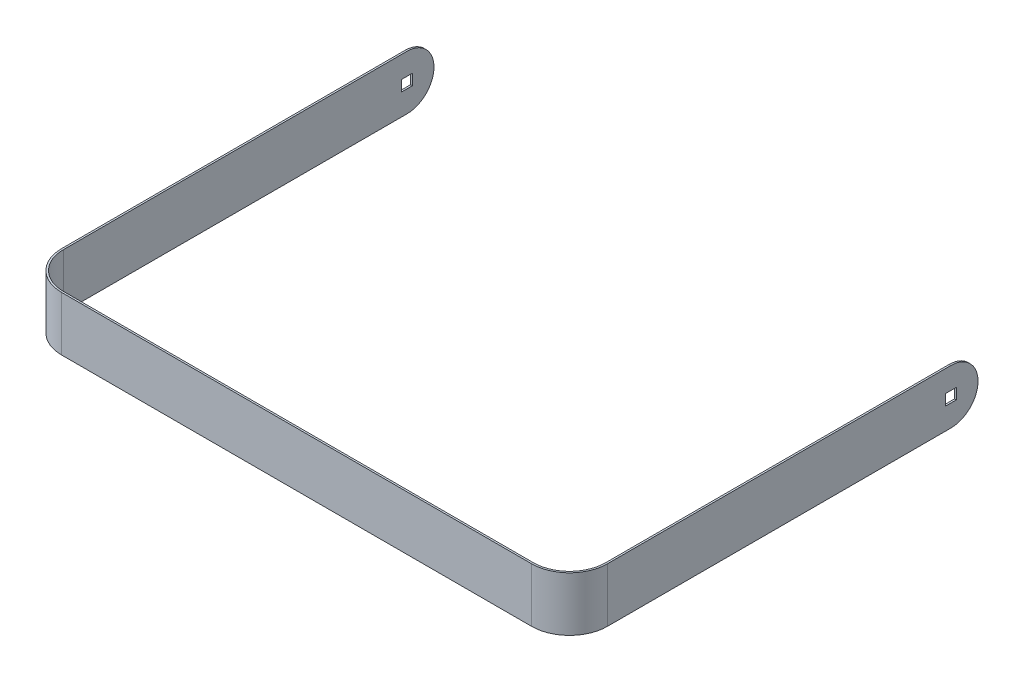
ISO-10303-21;
HEADER;
FILE_DESCRIPTION(('STEP AP214'),'2;1');
FILE_NAME('part.step','',(''),(''),'','','');
FILE_SCHEMA(('AUTOMOTIVE_DESIGN { 1 0 10303 214 1 1 1 1 }'));
ENDSEC;
DATA;
#1=APPLICATION_CONTEXT('core data for automotive mechanical design processes');
#2=APPLICATION_PROTOCOL_DEFINITION('international standard','automotive_design',2000,#1);
#3=PRODUCT_CONTEXT('',#1,'mechanical');
#4=PRODUCT('Part','Part','',(#3));
#5=PRODUCT_RELATED_PRODUCT_CATEGORY('part','',(#4));
#6=PRODUCT_DEFINITION_FORMATION('','',#4);
#7=PRODUCT_DEFINITION_CONTEXT('part definition',#1,'design');
#8=PRODUCT_DEFINITION('design','',#6,#7);
#9=PRODUCT_DEFINITION_SHAPE('','',#8);
#10=(LENGTH_UNIT() NAMED_UNIT(*) SI_UNIT(.MILLI.,.METRE.));
#11=(NAMED_UNIT(*) PLANE_ANGLE_UNIT() SI_UNIT($,.RADIAN.));
#12=(NAMED_UNIT(*) SI_UNIT($,.STERADIAN.) SOLID_ANGLE_UNIT());
#13=UNCERTAINTY_MEASURE_WITH_UNIT(LENGTH_MEASURE(1.E-05),#10,'distance_accuracy_value','');
#14=(GEOMETRIC_REPRESENTATION_CONTEXT(3) GLOBAL_UNCERTAINTY_ASSIGNED_CONTEXT((#13)) GLOBAL_UNIT_ASSIGNED_CONTEXT((#10,
#11,#12)) REPRESENTATION_CONTEXT('',''));
#15=CARTESIAN_POINT('',(0.,0.,0.));
#16=DIRECTION('',(0.,0.,1.));
#17=DIRECTION('',(1.,0.,0.));
#18=AXIS2_PLACEMENT_3D('',#15,#16,#17);
#19=CARTESIAN_POINT('',(130.,-30.,-21.));
#20=DIRECTION('',(0.,1.,0.));
#21=DIRECTION('',(0.,0.,1.));
#22=AXIS2_PLACEMENT_3D('',#19,#20,#21);
#23=PLANE('',#22);
#24=DIRECTION('',(1.,0.,0.));
#25=VECTOR('',#24,1.);
#26=CARTESIAN_POINT('',(-151.,-30.,-211.));
#27=LINE('',#26,#25);
#28=CARTESIAN_POINT('',(150.,-30.,-211.));
#29=VERTEX_POINT('',#28);
#30=CARTESIAN_POINT('',(151.,-30.,-211.));
#31=VERTEX_POINT('',#30);
#32=EDGE_CURVE('E235',#29,#31,#27,.T.);
#33=ORIENTED_EDGE('',*,*,#32,.T.);
#34=DIRECTION('',(0.,0.,-1.));
#35=VECTOR('',#34,1.);
#36=CARTESIAN_POINT('',(151.,-30.,-151.));
#37=LINE('',#36,#35);
#38=CARTESIAN_POINT('',(151.,-30.,-21.));
#39=VERTEX_POINT('',#38);
#40=EDGE_CURVE('E246',#39,#31,#37,.T.);
#41=ORIENTED_EDGE('',*,*,#40,.F.);
#42=CARTESIAN_POINT('',(130.,-30.,-21.));
#43=DIRECTION('',(0.,1.,0.));
#44=DIRECTION('',(0.,0.,1.));
#45=AXIS2_PLACEMENT_3D('',#42,#43,#44);
#46=CIRCLE('',#45,21.);
#47=CARTESIAN_POINT('',(130.,-30.,0.));
#48=VERTEX_POINT('',#47);
#49=EDGE_CURVE('E250',#48,#39,#46,.T.);
#50=ORIENTED_EDGE('',*,*,#49,.F.);
#51=DIRECTION('',(1.,0.,0.));
#52=VECTOR('',#51,1.);
#53=CARTESIAN_POINT('',(-130.,-30.,0.));
#54=LINE('',#53,#52);
#55=CARTESIAN_POINT('',(-130.,-30.,0.));
#56=VERTEX_POINT('',#55);
#57=EDGE_CURVE('E253',#56,#48,#54,.T.);
#58=ORIENTED_EDGE('',*,*,#57,.F.);
#59=CARTESIAN_POINT('',(-130.,-30.,-21.0000000000001));
#60=DIRECTION('',(0.,1.,0.));
#61=DIRECTION('',(0.,0.,1.));
#62=AXIS2_PLACEMENT_3D('',#59,#60,#61);
#63=CIRCLE('',#62,21.0000000000001);
#64=CARTESIAN_POINT('',(-151.,-30.,-21.0000000000001));
#65=VERTEX_POINT('',#64);
#66=EDGE_CURVE('E256',#65,#56,#63,.T.);
#67=ORIENTED_EDGE('',*,*,#66,.F.);
#68=DIRECTION('',(0.,0.,1.));
#69=VECTOR('',#68,1.);
#70=CARTESIAN_POINT('',(-151.,-30.,-151.));
#71=LINE('',#70,#69);
#72=CARTESIAN_POINT('',(-151.,-30.,-211.));
#73=VERTEX_POINT('',#72);
#74=EDGE_CURVE('E259',#73,#65,#71,.T.);
#75=ORIENTED_EDGE('',*,*,#74,.F.);
#76=CARTESIAN_POINT('',(-150.,-30.,-211.));
#77=VERTEX_POINT('',#76);
#78=EDGE_CURVE('E231',#73,#77,#27,.T.);
#79=ORIENTED_EDGE('',*,*,#78,.T.);
#80=DIRECTION('',(0.,0.,1.));
#81=VECTOR('',#80,1.);
#82=CARTESIAN_POINT('',(-150.,-30.,-151.));
#83=LINE('',#82,#81);
#84=CARTESIAN_POINT('',(-150.,-30.,-21.0000000000001));
#85=VERTEX_POINT('',#84);
#86=EDGE_CURVE('E261',#77,#85,#83,.T.);
#87=ORIENTED_EDGE('',*,*,#86,.T.);
#88=CARTESIAN_POINT('',(-130.,-30.,-21.0000000000001));
#89=DIRECTION('',(0.,-1.,0.));
#90=DIRECTION('',(1.,0.,0.));
#91=AXIS2_PLACEMENT_3D('',#88,#89,#90);
#92=CIRCLE('',#91,20.0000000000001);
#93=CARTESIAN_POINT('',(-130.,-30.,-1.));
#94=VERTEX_POINT('',#93);
#95=EDGE_CURVE('E263',#85,#94,#92,.F.);
#96=ORIENTED_EDGE('',*,*,#95,.T.);
#97=DIRECTION('',(1.,0.,0.));
#98=VECTOR('',#97,1.);
#99=CARTESIAN_POINT('',(-130.,-30.,-1.));
#100=LINE('',#99,#98);
#101=CARTESIAN_POINT('',(130.,-30.,-0.999999999999997));
#102=VERTEX_POINT('',#101);
#103=EDGE_CURVE('E265',#94,#102,#100,.T.);
#104=ORIENTED_EDGE('',*,*,#103,.T.);
#105=CARTESIAN_POINT('',(130.,-30.,-21.));
#106=DIRECTION('',(0.,-1.,0.));
#107=DIRECTION('',(1.,0.,0.));
#108=AXIS2_PLACEMENT_3D('',#105,#106,#107);
#109=CIRCLE('',#108,20.);
#110=CARTESIAN_POINT('',(150.,-30.,-21.));
#111=VERTEX_POINT('',#110);
#112=EDGE_CURVE('E267',#102,#111,#109,.F.);
#113=ORIENTED_EDGE('',*,*,#112,.T.);
#114=DIRECTION('',(0.,0.,-1.));
#115=VECTOR('',#114,1.);
#116=CARTESIAN_POINT('',(150.,-30.,-151.));
#117=LINE('',#116,#115);
#118=EDGE_CURVE('E243',#111,#29,#117,.T.);
#119=ORIENTED_EDGE('',*,*,#118,.T.);
#120=EDGE_LOOP('',(#33,#41,#50,#58,#67,#75,#79,#87,#96,#104,#113,#119));
#121=FACE_BOUND('',#120,.T.);
#122=ADVANCED_FACE('F31',(#121),#23,.F.);
#123=CARTESIAN_POINT('',(130.,0.,-21.));
#124=DIRECTION('',(0.,1.,0.));
#125=DIRECTION('',(0.,0.,1.));
#126=AXIS2_PLACEMENT_3D('',#123,#124,#125);
#127=PLANE('',#126);
#128=DIRECTION('',(0.,0.,-1.));
#129=VECTOR('',#128,1.);
#130=CARTESIAN_POINT('',(151.,0.,-21.));
#131=LINE('',#130,#129);
#132=CARTESIAN_POINT('',(151.,0.,-21.));
#133=VERTEX_POINT('',#132);
#134=CARTESIAN_POINT('',(151.,0.,-211.));
#135=VERTEX_POINT('',#134);
#136=EDGE_CURVE('E242',#133,#135,#131,.T.);
#137=ORIENTED_EDGE('',*,*,#136,.T.);
#138=DIRECTION('',(1.,0.,0.));
#139=VECTOR('',#138,1.);
#140=CARTESIAN_POINT('',(-151.,0.,-211.));
#141=LINE('',#140,#139);
#142=CARTESIAN_POINT('',(150.,0.,-211.));
#143=VERTEX_POINT('',#142);
#144=EDGE_CURVE('E314',#135,#143,#141,.F.);
#145=ORIENTED_EDGE('',*,*,#144,.T.);
#146=DIRECTION('',(0.,0.,1.));
#147=VECTOR('',#146,1.);
#148=CARTESIAN_POINT('',(150.,0.,-21.));
#149=LINE('',#148,#147);
#150=CARTESIAN_POINT('',(150.,0.,-21.));
#151=VERTEX_POINT('',#150);
#152=EDGE_CURVE('E247',#151,#143,#149,.F.);
#153=ORIENTED_EDGE('',*,*,#152,.F.);
#154=CARTESIAN_POINT('',(130.,0.,-21.));
#155=DIRECTION('',(0.,-1.,0.));
#156=DIRECTION('',(1.,0.,0.));
#157=AXIS2_PLACEMENT_3D('',#154,#155,#156);
#158=CIRCLE('',#157,20.);
#159=CARTESIAN_POINT('',(130.,0.,-0.999999999999997));
#160=VERTEX_POINT('',#159);
#161=EDGE_CURVE('E290',#160,#151,#158,.F.);
#162=ORIENTED_EDGE('',*,*,#161,.F.);
#163=DIRECTION('',(1.,0.,0.));
#164=VECTOR('',#163,1.);
#165=CARTESIAN_POINT('',(-130.,0.,-1.));
#166=LINE('',#165,#164);
#167=CARTESIAN_POINT('',(-130.,0.,-1.));
#168=VERTEX_POINT('',#167);
#169=EDGE_CURVE('E288',#168,#160,#166,.T.);
#170=ORIENTED_EDGE('',*,*,#169,.F.);
#171=CARTESIAN_POINT('',(-130.,0.,-21.0000000000001));
#172=DIRECTION('',(0.,-1.,0.));
#173=DIRECTION('',(1.,0.,0.));
#174=AXIS2_PLACEMENT_3D('',#171,#172,#173);
#175=CIRCLE('',#174,20.0000000000001);
#176=CARTESIAN_POINT('',(-150.,0.,-21.0000000000001));
#177=VERTEX_POINT('',#176);
#178=EDGE_CURVE('E286',#177,#168,#175,.F.);
#179=ORIENTED_EDGE('',*,*,#178,.F.);
#180=DIRECTION('',(0.,0.,1.));
#181=VECTOR('',#180,1.);
#182=CARTESIAN_POINT('',(-150.,0.,-151.));
#183=LINE('',#182,#181);
#184=CARTESIAN_POINT('',(-150.,0.,-211.));
#185=VERTEX_POINT('',#184);
#186=EDGE_CURVE('E284',#185,#177,#183,.T.);
#187=ORIENTED_EDGE('',*,*,#186,.F.);
#188=DIRECTION('',(1.,0.,0.));
#189=VECTOR('',#188,1.);
#190=CARTESIAN_POINT('',(-151.,0.,-211.));
#191=LINE('',#190,#189);
#192=CARTESIAN_POINT('',(-151.,0.,-211.));
#193=VERTEX_POINT('',#192);
#194=EDGE_CURVE('E229',#193,#185,#191,.T.);
#195=ORIENTED_EDGE('',*,*,#194,.F.);
#196=DIRECTION('',(0.,0.,1.));
#197=VECTOR('',#196,1.);
#198=CARTESIAN_POINT('',(-151.,0.,-151.));
#199=LINE('',#198,#197);
#200=CARTESIAN_POINT('',(-151.,0.,-21.0000000000001));
#201=VERTEX_POINT('',#200);
#202=EDGE_CURVE('E282',#193,#201,#199,.T.);
#203=ORIENTED_EDGE('',*,*,#202,.T.);
#204=CARTESIAN_POINT('',(-130.,0.,-21.0000000000001));
#205=DIRECTION('',(0.,1.,0.));
#206=DIRECTION('',(0.,0.,1.));
#207=AXIS2_PLACEMENT_3D('',#204,#205,#206);
#208=CIRCLE('',#207,21.0000000000001);
#209=CARTESIAN_POINT('',(-130.,0.,0.));
#210=VERTEX_POINT('',#209);
#211=EDGE_CURVE('E279',#201,#210,#208,.T.);
#212=ORIENTED_EDGE('',*,*,#211,.T.);
#213=DIRECTION('',(1.,0.,0.));
#214=VECTOR('',#213,1.);
#215=CARTESIAN_POINT('',(-130.,0.,0.));
#216=LINE('',#215,#214);
#217=CARTESIAN_POINT('',(130.,0.,0.));
#218=VERTEX_POINT('',#217);
#219=EDGE_CURVE('E276',#210,#218,#216,.T.);
#220=ORIENTED_EDGE('',*,*,#219,.T.);
#221=CARTESIAN_POINT('',(130.,0.,-21.));
#222=DIRECTION('',(0.,1.,0.));
#223=DIRECTION('',(0.,0.,1.));
#224=AXIS2_PLACEMENT_3D('',#221,#222,#223);
#225=CIRCLE('',#224,21.);
#226=EDGE_CURVE('E273',#218,#133,#225,.T.);
#227=ORIENTED_EDGE('',*,*,#226,.T.);
#228=EDGE_LOOP('',(#137,#145,#153,#162,#170,#179,#187,#195,#203,#212,#220,#227));
#229=FACE_BOUND('',#228,.T.);
#230=ADVANCED_FACE('F352',(#229),#127,.T.);
#231=CARTESIAN_POINT('',(151.,-30.,-21.));
#232=DIRECTION('',(1.,0.,0.));
#233=DIRECTION('',(0.,0.,-1.));
#234=AXIS2_PLACEMENT_3D('',#231,#232,#233);
#235=PLANE('',#234);
#236=DIRECTION('',(0.,-1.,0.));
#237=VECTOR('',#236,1.);
#238=CARTESIAN_POINT('',(151.,-12.,-208.));
#239=LINE('',#238,#237);
#240=CARTESIAN_POINT('',(151.,-12.,-208.));
#241=VERTEX_POINT('',#240);
#242=CARTESIAN_POINT('',(151.,-18.,-208.));
#243=VERTEX_POINT('',#242);
#244=EDGE_CURVE('E46',#241,#243,#239,.T.);
#245=ORIENTED_EDGE('',*,*,#244,.F.);
#246=DIRECTION('',(0.,0.,1.));
#247=VECTOR('',#246,1.);
#248=CARTESIAN_POINT('',(151.,-12.,-208.));
#249=LINE('',#248,#247);
#250=CARTESIAN_POINT('',(151.,-12.,-214.));
#251=VERTEX_POINT('',#250);
#252=EDGE_CURVE('E194',#251,#241,#249,.T.);
#253=ORIENTED_EDGE('',*,*,#252,.F.);
#254=DIRECTION('',(0.,1.,0.));
#255=VECTOR('',#254,1.);
#256=CARTESIAN_POINT('',(151.,-12.,-214.));
#257=LINE('',#256,#255);
#258=CARTESIAN_POINT('',(151.,-18.,-214.));
#259=VERTEX_POINT('',#258);
#260=EDGE_CURVE('E197',#259,#251,#257,.T.);
#261=ORIENTED_EDGE('',*,*,#260,.F.);
#262=DIRECTION('',(0.,0.,-1.));
#263=VECTOR('',#262,1.);
#264=CARTESIAN_POINT('',(151.,-18.,-208.));
#265=LINE('',#264,#263);
#266=EDGE_CURVE('E203',#243,#259,#265,.T.);
#267=ORIENTED_EDGE('',*,*,#266,.F.);
#268=EDGE_LOOP('',(#245,#253,#261,#267));
#269=FACE_BOUND('',#268,.T.);
#270=CARTESIAN_POINT('',(151.,-15.,-211.));
#271=DIRECTION('',(-1.,0.,0.));
#272=DIRECTION('',(0.,0.,1.));
#273=AXIS2_PLACEMENT_3D('',#270,#271,#272);
#274=CIRCLE('',#273,15.);
#275=EDGE_CURVE('E225',#135,#31,#274,.T.);
#276=ORIENTED_EDGE('',*,*,#275,.F.);
#277=ORIENTED_EDGE('',*,*,#136,.F.);
#278=DIRECTION('',(0.,1.,0.));
#279=VECTOR('',#278,1.);
#280=CARTESIAN_POINT('',(151.,-30.,-21.));
#281=LINE('',#280,#279);
#282=EDGE_CURVE('E312',#39,#133,#281,.T.);
#283=ORIENTED_EDGE('',*,*,#282,.F.);
#284=ORIENTED_EDGE('',*,*,#40,.T.);
#285=EDGE_LOOP('',(#276,#277,#283,#284));
#286=FACE_BOUND('',#285,.T.);
#287=ADVANCED_FACE('F33',(#269,#286),#235,.T.);
#288=CARTESIAN_POINT('',(130.,-30.,-21.));
#289=DIRECTION('',(0.,1.,0.));
#290=DIRECTION('',(0.,0.,1.));
#291=AXIS2_PLACEMENT_3D('',#288,#289,#290);
#292=CYLINDRICAL_SURFACE('',#291,21.);
#293=ORIENTED_EDGE('',*,*,#226,.F.);
#294=DIRECTION('',(0.,1.,0.));
#295=VECTOR('',#294,1.);
#296=CARTESIAN_POINT('',(130.,-30.,0.));
#297=LINE('',#296,#295);
#298=EDGE_CURVE('E310',#48,#218,#297,.T.);
#299=ORIENTED_EDGE('',*,*,#298,.F.);
#300=ORIENTED_EDGE('',*,*,#49,.T.);
#301=ORIENTED_EDGE('',*,*,#282,.T.);
#302=EDGE_LOOP('',(#293,#299,#300,#301));
#303=FACE_BOUND('',#302,.T.);
#304=ADVANCED_FACE('F390',(#303),#292,.T.);
#305=CARTESIAN_POINT('',(-130.,-30.,0.));
#306=DIRECTION('',(0.,0.,1.));
#307=DIRECTION('',(1.,0.,0.));
#308=AXIS2_PLACEMENT_3D('',#305,#306,#307);
#309=PLANE('',#308);
#310=ORIENTED_EDGE('',*,*,#219,.F.);
#311=DIRECTION('',(0.,1.,0.));
#312=VECTOR('',#311,1.);
#313=CARTESIAN_POINT('',(-130.,-30.,0.));
#314=LINE('',#313,#312);
#315=EDGE_CURVE('E308',#56,#210,#314,.T.);
#316=ORIENTED_EDGE('',*,*,#315,.F.);
#317=ORIENTED_EDGE('',*,*,#57,.T.);
#318=ORIENTED_EDGE('',*,*,#298,.T.);
#319=EDGE_LOOP('',(#310,#316,#317,#318));
#320=FACE_BOUND('',#319,.T.);
#321=ADVANCED_FACE('F387',(#320),#309,.T.);
#322=CARTESIAN_POINT('',(-130.,-30.,-21.0000000000001));
#323=DIRECTION('',(0.,1.,0.));
#324=DIRECTION('',(0.,0.,1.));
#325=AXIS2_PLACEMENT_3D('',#322,#323,#324);
#326=CYLINDRICAL_SURFACE('',#325,21.0000000000001);
#327=ORIENTED_EDGE('',*,*,#211,.F.);
#328=DIRECTION('',(0.,1.,0.));
#329=VECTOR('',#328,1.);
#330=CARTESIAN_POINT('',(-151.,-30.,-21.0000000000001));
#331=LINE('',#330,#329);
#332=EDGE_CURVE('E305',#65,#201,#331,.T.);
#333=ORIENTED_EDGE('',*,*,#332,.F.);
#334=ORIENTED_EDGE('',*,*,#66,.T.);
#335=ORIENTED_EDGE('',*,*,#315,.T.);
#336=EDGE_LOOP('',(#327,#333,#334,#335));
#337=FACE_BOUND('',#336,.T.);
#338=ADVANCED_FACE('F384',(#337),#326,.T.);
#339=CARTESIAN_POINT('',(-151.,-30.,-151.));
#340=DIRECTION('',(-1.,0.,0.));
#341=DIRECTION('',(0.,0.,1.));
#342=AXIS2_PLACEMENT_3D('',#339,#340,#341);
#343=PLANE('',#342);
#344=DIRECTION('',(0.,-1.,0.));
#345=VECTOR('',#344,1.);
#346=CARTESIAN_POINT('',(-151.,-12.,-208.));
#347=LINE('',#346,#345);
#348=CARTESIAN_POINT('',(-151.,-12.,-208.));
#349=VERTEX_POINT('',#348);
#350=CARTESIAN_POINT('',(-151.,-18.,-208.));
#351=VERTEX_POINT('',#350);
#352=EDGE_CURVE('E175',#349,#351,#347,.T.);
#353=ORIENTED_EDGE('',*,*,#352,.T.);
#354=DIRECTION('',(0.,0.,-1.));
#355=VECTOR('',#354,1.);
#356=CARTESIAN_POINT('',(-151.,-18.,-208.));
#357=LINE('',#356,#355);
#358=CARTESIAN_POINT('',(-151.,-18.,-214.));
#359=VERTEX_POINT('',#358);
#360=EDGE_CURVE('E185',#351,#359,#357,.T.);
#361=ORIENTED_EDGE('',*,*,#360,.T.);
#362=DIRECTION('',(0.,1.,0.));
#363=VECTOR('',#362,1.);
#364=CARTESIAN_POINT('',(-151.,-12.,-214.));
#365=LINE('',#364,#363);
#366=CARTESIAN_POINT('',(-151.,-12.,-214.));
#367=VERTEX_POINT('',#366);
#368=EDGE_CURVE('E54',#359,#367,#365,.T.);
#369=ORIENTED_EDGE('',*,*,#368,.T.);
#370=DIRECTION('',(0.,0.,1.));
#371=VECTOR('',#370,1.);
#372=CARTESIAN_POINT('',(-151.,-12.,-208.));
#373=LINE('',#372,#371);
#374=EDGE_CURVE('E193',#367,#349,#373,.T.);
#375=ORIENTED_EDGE('',*,*,#374,.T.);
#376=EDGE_LOOP('',(#353,#361,#369,#375));
#377=FACE_BOUND('',#376,.T.);
#378=CARTESIAN_POINT('',(-151.,-15.,-211.));
#379=DIRECTION('',(-1.,0.,0.));
#380=DIRECTION('',(0.,0.,1.));
#381=AXIS2_PLACEMENT_3D('',#378,#379,#380);
#382=CIRCLE('',#381,15.);
#383=EDGE_CURVE('E226',#193,#73,#382,.T.);
#384=ORIENTED_EDGE('',*,*,#383,.T.);
#385=ORIENTED_EDGE('',*,*,#74,.T.);
#386=ORIENTED_EDGE('',*,*,#332,.T.);
#387=ORIENTED_EDGE('',*,*,#202,.F.);
#388=EDGE_LOOP('',(#384,#385,#386,#387));
#389=FACE_BOUND('',#388,.T.);
#390=ADVANCED_FACE('F190',(#377,#389),#343,.T.);
#391=CARTESIAN_POINT('',(-150.,-30.,-151.));
#392=DIRECTION('',(-1.,0.,0.));
#393=DIRECTION('',(0.,0.,1.));
#394=AXIS2_PLACEMENT_3D('',#391,#392,#393);
#395=PLANE('',#394);
#396=DIRECTION('',(0.,0.,1.));
#397=VECTOR('',#396,1.);
#398=CARTESIAN_POINT('',(-150.,-18.,-151.));
#399=LINE('',#398,#397);
#400=CARTESIAN_POINT('',(-150.,-18.,-214.));
#401=VERTEX_POINT('',#400);
#402=CARTESIAN_POINT('',(-150.,-18.,-208.));
#403=VERTEX_POINT('',#402);
#404=EDGE_CURVE('E210',#401,#403,#399,.T.);
#405=ORIENTED_EDGE('',*,*,#404,.T.);
#406=DIRECTION('',(0.,1.,0.));
#407=VECTOR('',#406,1.);
#408=CARTESIAN_POINT('',(-150.,-30.,-208.));
#409=LINE('',#408,#407);
#410=CARTESIAN_POINT('',(-150.,-12.,-208.));
#411=VERTEX_POINT('',#410);
#412=EDGE_CURVE('E178',#403,#411,#409,.T.);
#413=ORIENTED_EDGE('',*,*,#412,.T.);
#414=DIRECTION('',(0.,0.,-1.));
#415=VECTOR('',#414,1.);
#416=CARTESIAN_POINT('',(-150.,-12.,-151.));
#417=LINE('',#416,#415);
#418=CARTESIAN_POINT('',(-150.,-12.,-214.));
#419=VERTEX_POINT('',#418);
#420=EDGE_CURVE('E221',#411,#419,#417,.T.);
#421=ORIENTED_EDGE('',*,*,#420,.T.);
#422=DIRECTION('',(0.,-1.,0.));
#423=VECTOR('',#422,1.);
#424=CARTESIAN_POINT('',(-150.,-30.,-214.));
#425=LINE('',#424,#423);
#426=EDGE_CURVE('E218',#419,#401,#425,.T.);
#427=ORIENTED_EDGE('',*,*,#426,.T.);
#428=EDGE_LOOP('',(#405,#413,#421,#427));
#429=FACE_BOUND('',#428,.T.);
#430=ORIENTED_EDGE('',*,*,#86,.F.);
#431=CARTESIAN_POINT('',(-150.,-15.,-211.));
#432=DIRECTION('',(-1.,0.,0.));
#433=DIRECTION('',(0.,0.,1.));
#434=AXIS2_PLACEMENT_3D('',#431,#432,#433);
#435=CIRCLE('',#434,15.);
#436=EDGE_CURVE('E240',#77,#185,#435,.F.);
#437=ORIENTED_EDGE('',*,*,#436,.T.);
#438=ORIENTED_EDGE('',*,*,#186,.T.);
#439=DIRECTION('',(0.,1.,0.));
#440=VECTOR('',#439,1.);
#441=CARTESIAN_POINT('',(-150.,-30.,-21.0000000000001));
#442=LINE('',#441,#440);
#443=EDGE_CURVE('E302',#85,#177,#442,.T.);
#444=ORIENTED_EDGE('',*,*,#443,.F.);
#445=EDGE_LOOP('',(#430,#437,#438,#444));
#446=FACE_BOUND('',#445,.T.);
#447=ADVANCED_FACE('F377',(#429,#446),#395,.F.);
#448=CARTESIAN_POINT('',(-130.,-30.,-21.0000000000001));
#449=DIRECTION('',(0.,1.,0.));
#450=DIRECTION('',(0.,0.,1.));
#451=AXIS2_PLACEMENT_3D('',#448,#449,#450);
#452=CYLINDRICAL_SURFACE('',#451,20.0000000000001);
#453=ORIENTED_EDGE('',*,*,#178,.T.);
#454=DIRECTION('',(0.,1.,0.));
#455=VECTOR('',#454,1.);
#456=CARTESIAN_POINT('',(-130.,-30.,-1.));
#457=LINE('',#456,#455);
#458=EDGE_CURVE('E299',#94,#168,#457,.T.);
#459=ORIENTED_EDGE('',*,*,#458,.F.);
#460=ORIENTED_EDGE('',*,*,#95,.F.);
#461=ORIENTED_EDGE('',*,*,#443,.T.);
#462=EDGE_LOOP('',(#453,#459,#460,#461));
#463=FACE_BOUND('',#462,.T.);
#464=ADVANCED_FACE('F373',(#463),#452,.F.);
#465=CARTESIAN_POINT('',(-130.,-30.,-1.));
#466=DIRECTION('',(0.,0.,1.));
#467=DIRECTION('',(1.,0.,0.));
#468=AXIS2_PLACEMENT_3D('',#465,#466,#467);
#469=PLANE('',#468);
#470=ORIENTED_EDGE('',*,*,#169,.T.);
#471=DIRECTION('',(0.,1.,0.));
#472=VECTOR('',#471,1.);
#473=CARTESIAN_POINT('',(130.,-30.,-0.999999999999997));
#474=LINE('',#473,#472);
#475=EDGE_CURVE('E296',#102,#160,#474,.T.);
#476=ORIENTED_EDGE('',*,*,#475,.F.);
#477=ORIENTED_EDGE('',*,*,#103,.F.);
#478=ORIENTED_EDGE('',*,*,#458,.T.);
#479=EDGE_LOOP('',(#470,#476,#477,#478));
#480=FACE_BOUND('',#479,.T.);
#481=ADVANCED_FACE('F369',(#480),#469,.F.);
#482=CARTESIAN_POINT('',(130.,-30.,-21.));
#483=DIRECTION('',(0.,1.,0.));
#484=DIRECTION('',(0.,0.,1.));
#485=AXIS2_PLACEMENT_3D('',#482,#483,#484);
#486=CYLINDRICAL_SURFACE('',#485,20.);
#487=ORIENTED_EDGE('',*,*,#161,.T.);
#488=DIRECTION('',(0.,1.,0.));
#489=VECTOR('',#488,1.);
#490=CARTESIAN_POINT('',(150.,-30.,-21.));
#491=LINE('',#490,#489);
#492=EDGE_CURVE('E270',#111,#151,#491,.T.);
#493=ORIENTED_EDGE('',*,*,#492,.F.);
#494=ORIENTED_EDGE('',*,*,#112,.F.);
#495=ORIENTED_EDGE('',*,*,#475,.T.);
#496=EDGE_LOOP('',(#487,#493,#494,#495));
#497=FACE_BOUND('',#496,.T.);
#498=ADVANCED_FACE('F366',(#497),#486,.F.);
#499=CARTESIAN_POINT('',(150.,-30.,-21.));
#500=DIRECTION('',(1.,0.,0.));
#501=DIRECTION('',(0.,0.,-1.));
#502=AXIS2_PLACEMENT_3D('',#499,#500,#501);
#503=PLANE('',#502);
#504=DIRECTION('',(0.,0.,1.));
#505=VECTOR('',#504,1.);
#506=CARTESIAN_POINT('',(150.,-12.,-21.));
#507=LINE('',#506,#505);
#508=CARTESIAN_POINT('',(150.,-12.,-214.));
#509=VERTEX_POINT('',#508);
#510=CARTESIAN_POINT('',(150.,-12.,-208.));
#511=VERTEX_POINT('',#510);
#512=EDGE_CURVE('E39',#509,#511,#507,.T.);
#513=ORIENTED_EDGE('',*,*,#512,.T.);
#514=DIRECTION('',(0.,-1.,0.));
#515=VECTOR('',#514,1.);
#516=CARTESIAN_POINT('',(150.,-30.,-208.));
#517=LINE('',#516,#515);
#518=CARTESIAN_POINT('',(150.,-18.,-208.));
#519=VERTEX_POINT('',#518);
#520=EDGE_CURVE('E11',#511,#519,#517,.T.);
#521=ORIENTED_EDGE('',*,*,#520,.T.);
#522=DIRECTION('',(0.,0.,-1.));
#523=VECTOR('',#522,1.);
#524=CARTESIAN_POINT('',(150.,-18.,-21.));
#525=LINE('',#524,#523);
#526=CARTESIAN_POINT('',(150.,-18.,-214.));
#527=VERTEX_POINT('',#526);
#528=EDGE_CURVE('E317',#519,#527,#525,.T.);
#529=ORIENTED_EDGE('',*,*,#528,.T.);
#530=DIRECTION('',(0.,1.,0.));
#531=VECTOR('',#530,1.);
#532=CARTESIAN_POINT('',(150.,-30.,-214.));
#533=LINE('',#532,#531);
#534=EDGE_CURVE('E320',#527,#509,#533,.T.);
#535=ORIENTED_EDGE('',*,*,#534,.T.);
#536=EDGE_LOOP('',(#513,#521,#529,#535));
#537=FACE_BOUND('',#536,.T.);
#538=ORIENTED_EDGE('',*,*,#152,.T.);
#539=CARTESIAN_POINT('',(150.,-15.,-211.));
#540=DIRECTION('',(1.,0.,0.));
#541=DIRECTION('',(0.,0.,-1.));
#542=AXIS2_PLACEMENT_3D('',#539,#540,#541);
#543=CIRCLE('',#542,15.);
#544=EDGE_CURVE('E234',#143,#29,#543,.F.);
#545=ORIENTED_EDGE('',*,*,#544,.T.);
#546=ORIENTED_EDGE('',*,*,#118,.F.);
#547=ORIENTED_EDGE('',*,*,#492,.T.);
#548=EDGE_LOOP('',(#538,#545,#546,#547));
#549=FACE_BOUND('',#548,.T.);
#550=ADVANCED_FACE('F324',(#537,#549),#503,.F.);
#551=CARTESIAN_POINT('',(-151.,-15.,-211.));
#552=DIRECTION('',(1.,0.,0.));
#553=DIRECTION('',(0.,0.,-1.));
#554=AXIS2_PLACEMENT_3D('',#551,#552,#553);
#555=CYLINDRICAL_SURFACE('',#554,15.);
#556=ORIENTED_EDGE('',*,*,#436,.F.);
#557=ORIENTED_EDGE('',*,*,#78,.F.);
#558=ORIENTED_EDGE('',*,*,#383,.F.);
#559=ORIENTED_EDGE('',*,*,#194,.T.);
#560=EDGE_LOOP('',(#556,#557,#558,#559));
#561=FACE_BOUND('',#560,.T.);
#562=ADVANCED_FACE('F365',(#561),#555,.T.);
#563=ORIENTED_EDGE('',*,*,#275,.T.);
#564=ORIENTED_EDGE('',*,*,#32,.F.);
#565=ORIENTED_EDGE('',*,*,#544,.F.);
#566=ORIENTED_EDGE('',*,*,#144,.F.);
#567=EDGE_LOOP('',(#563,#564,#565,#566));
#568=FACE_BOUND('',#567,.T.);
#569=ADVANCED_FACE('F361',(#568),#555,.T.);
#570=CARTESIAN_POINT('',(-151.,-18.,-208.));
#571=DIRECTION('',(0.,-1.,0.));
#572=DIRECTION('',(0.,0.,-1.));
#573=AXIS2_PLACEMENT_3D('',#570,#571,#572);
#574=PLANE('',#573);
#575=DIRECTION('',(1.,0.,0.));
#576=VECTOR('',#575,1.);
#577=CARTESIAN_POINT('',(-151.,-18.,-208.));
#578=LINE('',#577,#576);
#579=EDGE_CURVE('E182',#519,#243,#578,.T.);
#580=ORIENTED_EDGE('',*,*,#579,.T.);
#581=ORIENTED_EDGE('',*,*,#266,.T.);
#582=DIRECTION('',(1.,0.,0.));
#583=VECTOR('',#582,1.);
#584=CARTESIAN_POINT('',(-151.,-18.,-214.));
#585=LINE('',#584,#583);
#586=EDGE_CURVE('E181',#527,#259,#585,.T.);
#587=ORIENTED_EDGE('',*,*,#586,.F.);
#588=ORIENTED_EDGE('',*,*,#528,.F.);
#589=EDGE_LOOP('',(#580,#581,#587,#588));
#590=FACE_BOUND('',#589,.T.);
#591=ADVANCED_FACE('F339',(#590),#574,.F.);
#592=CARTESIAN_POINT('',(-151.,-12.,-214.));
#593=DIRECTION('',(0.,0.,-1.));
#594=DIRECTION('',(-1.,0.,0.));
#595=AXIS2_PLACEMENT_3D('',#592,#593,#594);
#596=PLANE('',#595);
#597=ORIENTED_EDGE('',*,*,#586,.T.);
#598=ORIENTED_EDGE('',*,*,#260,.T.);
#599=DIRECTION('',(1.,0.,0.));
#600=VECTOR('',#599,1.);
#601=CARTESIAN_POINT('',(-151.,-12.,-214.));
#602=LINE('',#601,#600);
#603=EDGE_CURVE('E215',#509,#251,#602,.T.);
#604=ORIENTED_EDGE('',*,*,#603,.F.);
#605=ORIENTED_EDGE('',*,*,#534,.F.);
#606=EDGE_LOOP('',(#597,#598,#604,#605));
#607=FACE_BOUND('',#606,.T.);
#608=ADVANCED_FACE('F332',(#607),#596,.F.);
#609=CARTESIAN_POINT('',(-151.,-12.,-208.));
#610=DIRECTION('',(0.,1.,0.));
#611=DIRECTION('',(0.,0.,1.));
#612=AXIS2_PLACEMENT_3D('',#609,#610,#611);
#613=PLANE('',#612);
#614=ORIENTED_EDGE('',*,*,#603,.T.);
#615=ORIENTED_EDGE('',*,*,#252,.T.);
#616=DIRECTION('',(1.,0.,0.));
#617=VECTOR('',#616,1.);
#618=CARTESIAN_POINT('',(-151.,-12.,-208.));
#619=LINE('',#618,#617);
#620=EDGE_CURVE('E211',#511,#241,#619,.T.);
#621=ORIENTED_EDGE('',*,*,#620,.F.);
#622=ORIENTED_EDGE('',*,*,#512,.F.);
#623=EDGE_LOOP('',(#614,#615,#621,#622));
#624=FACE_BOUND('',#623,.T.);
#625=ADVANCED_FACE('F330',(#624),#613,.F.);
#626=CARTESIAN_POINT('',(-151.,-12.,-208.));
#627=DIRECTION('',(0.,0.,1.));
#628=DIRECTION('',(1.,0.,0.));
#629=AXIS2_PLACEMENT_3D('',#626,#627,#628);
#630=PLANE('',#629);
#631=ORIENTED_EDGE('',*,*,#620,.T.);
#632=ORIENTED_EDGE('',*,*,#244,.T.);
#633=ORIENTED_EDGE('',*,*,#579,.F.);
#634=ORIENTED_EDGE('',*,*,#520,.F.);
#635=EDGE_LOOP('',(#631,#632,#633,#634));
#636=FACE_BOUND('',#635,.T.);
#637=ADVANCED_FACE('F340',(#636),#630,.F.);
#638=EDGE_CURVE('E170',#351,#403,#578,.T.);
#639=ORIENTED_EDGE('',*,*,#638,.F.);
#640=ORIENTED_EDGE('',*,*,#352,.F.);
#641=EDGE_CURVE('E208',#349,#411,#619,.T.);
#642=ORIENTED_EDGE('',*,*,#641,.T.);
#643=ORIENTED_EDGE('',*,*,#412,.F.);
#644=EDGE_LOOP('',(#639,#640,#642,#643));
#645=FACE_BOUND('',#644,.T.);
#646=ADVANCED_FACE('F172',(#645),#630,.F.);
#647=ORIENTED_EDGE('',*,*,#641,.F.);
#648=ORIENTED_EDGE('',*,*,#374,.F.);
#649=EDGE_CURVE('E212',#367,#419,#602,.T.);
#650=ORIENTED_EDGE('',*,*,#649,.T.);
#651=ORIENTED_EDGE('',*,*,#420,.F.);
#652=EDGE_LOOP('',(#647,#648,#650,#651));
#653=FACE_BOUND('',#652,.T.);
#654=ADVANCED_FACE('F347',(#653),#613,.F.);
#655=ORIENTED_EDGE('',*,*,#649,.F.);
#656=ORIENTED_EDGE('',*,*,#368,.F.);
#657=EDGE_CURVE('E187',#359,#401,#585,.T.);
#658=ORIENTED_EDGE('',*,*,#657,.T.);
#659=ORIENTED_EDGE('',*,*,#426,.F.);
#660=EDGE_LOOP('',(#655,#656,#658,#659));
#661=FACE_BOUND('',#660,.T.);
#662=ADVANCED_FACE('F519',(#661),#596,.F.);
#663=ORIENTED_EDGE('',*,*,#657,.F.);
#664=ORIENTED_EDGE('',*,*,#360,.F.);
#665=ORIENTED_EDGE('',*,*,#638,.T.);
#666=ORIENTED_EDGE('',*,*,#404,.F.);
#667=EDGE_LOOP('',(#663,#664,#665,#666));
#668=FACE_BOUND('',#667,.T.);
#669=ADVANCED_FACE('F186',(#668),#574,.F.);
#670=CLOSED_SHELL('',(#122,#230,#287,#304,#321,#338,#390,#447,#464,#481,#498,#550,#562,#569,
#591,#608,#625,#637,#646,#654,#662,#669));
#671=MANIFOLD_SOLID_BREP('B2',#670);
#672=ADVANCED_BREP_SHAPE_REPRESENTATION('',(#18,#671),#14);
#673=SHAPE_DEFINITION_REPRESENTATION(#9,#672);
ENDSEC;
END-ISO-10303-21;
